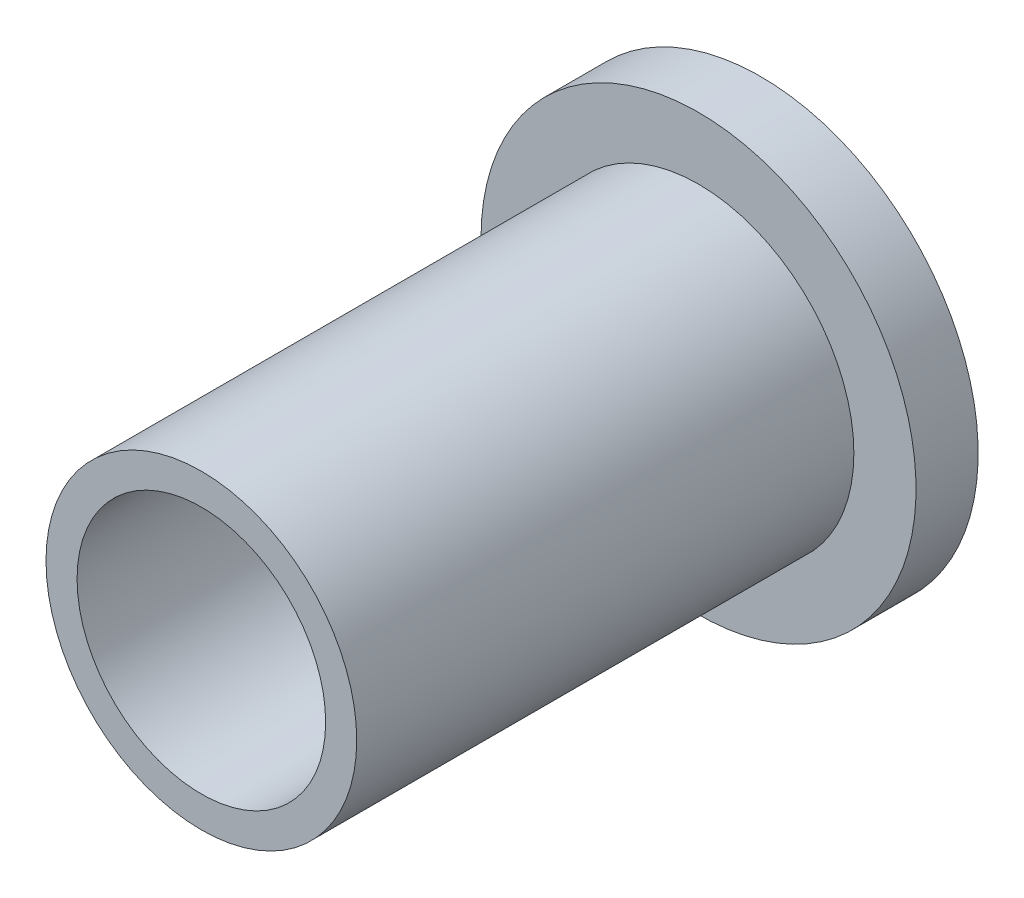
ISO-10303-21;
HEADER;
FILE_DESCRIPTION(('STEP AP214'),'2;1');
FILE_NAME('part.step','',(''),(''),'','','');
FILE_SCHEMA(('AUTOMOTIVE_DESIGN { 1 0 10303 214 1 1 1 1 }'));
ENDSEC;
DATA;
#1=APPLICATION_CONTEXT('core data for automotive mechanical design processes');
#2=APPLICATION_PROTOCOL_DEFINITION('international standard','automotive_design',2000,#1);
#3=PRODUCT_CONTEXT('',#1,'mechanical');
#4=PRODUCT('Part','Part','',(#3));
#5=PRODUCT_RELATED_PRODUCT_CATEGORY('part','',(#4));
#6=PRODUCT_DEFINITION_FORMATION('','',#4);
#7=PRODUCT_DEFINITION_CONTEXT('part definition',#1,'design');
#8=PRODUCT_DEFINITION('design','',#6,#7);
#9=PRODUCT_DEFINITION_SHAPE('','',#8);
#10=(LENGTH_UNIT() NAMED_UNIT(*) SI_UNIT(.MILLI.,.METRE.));
#11=(NAMED_UNIT(*) PLANE_ANGLE_UNIT() SI_UNIT($,.RADIAN.));
#12=(NAMED_UNIT(*) SI_UNIT($,.STERADIAN.) SOLID_ANGLE_UNIT());
#13=UNCERTAINTY_MEASURE_WITH_UNIT(LENGTH_MEASURE(1.E-05),#10,'distance_accuracy_value','');
#14=(GEOMETRIC_REPRESENTATION_CONTEXT(3) GLOBAL_UNCERTAINTY_ASSIGNED_CONTEXT((#13)) GLOBAL_UNIT_ASSIGNED_CONTEXT((#10,
#11,#12)) REPRESENTATION_CONTEXT('',''));
#15=CARTESIAN_POINT('',(0.,0.,0.));
#16=DIRECTION('',(0.,0.,1.));
#17=DIRECTION('',(1.,0.,0.));
#18=AXIS2_PLACEMENT_3D('',#15,#16,#17);
#19=CARTESIAN_POINT('',(0.,0.,25.4));
#20=DIRECTION('',(0.,0.,1.));
#21=DIRECTION('',(1.,0.,0.));
#22=AXIS2_PLACEMENT_3D('',#19,#20,#21);
#23=PLANE('',#22);
#24=CARTESIAN_POINT('',(0.,0.,25.4));
#25=DIRECTION('',(0.,0.,1.));
#26=DIRECTION('',(1.,0.,0.));
#27=AXIS2_PLACEMENT_3D('',#24,#25,#26);
#28=CIRCLE('',#27,7.9375);
#29=CARTESIAN_POINT('',(7.9375,0.,25.4));
#30=VERTEX_POINT('',#29);
#31=EDGE_CURVE('E10',#30,#30,#28,.T.);
#32=ORIENTED_EDGE('',*,*,#31,.T.);
#33=EDGE_LOOP('',(#32));
#34=FACE_BOUND('',#33,.T.);
#35=CARTESIAN_POINT('',(0.,0.,25.4));
#36=DIRECTION('',(0.,0.,1.));
#37=DIRECTION('',(1.,0.,0.));
#38=AXIS2_PLACEMENT_3D('',#35,#36,#37);
#39=CIRCLE('',#38,6.35);
#40=CARTESIAN_POINT('',(6.35,0.,25.4));
#41=VERTEX_POINT('',#40);
#42=EDGE_CURVE('E38',#41,#41,#39,.T.);
#43=ORIENTED_EDGE('',*,*,#42,.F.);
#44=EDGE_LOOP('',(#43));
#45=FACE_BOUND('',#44,.T.);
#46=ADVANCED_FACE('F31',(#34,#45),#23,.T.);
#47=CARTESIAN_POINT('',(0.,0.,25.4));
#48=DIRECTION('',(0.,0.,-1.));
#49=DIRECTION('',(-1.,0.,0.));
#50=AXIS2_PLACEMENT_3D('',#47,#48,#49);
#51=CYLINDRICAL_SURFACE('',#50,7.9375);
#52=ORIENTED_EDGE('',*,*,#31,.F.);
#53=EDGE_LOOP('',(#52));
#54=FACE_BOUND('',#53,.T.);
#55=CARTESIAN_POINT('',(0.,0.,0.));
#56=DIRECTION('',(0.,0.,-1.));
#57=DIRECTION('',(-1.,0.,0.));
#58=AXIS2_PLACEMENT_3D('',#55,#56,#57);
#59=CIRCLE('',#58,7.9375);
#60=CARTESIAN_POINT('',(-7.9375,0.,0.));
#61=VERTEX_POINT('',#60);
#62=EDGE_CURVE('E42',#61,#61,#59,.T.);
#63=ORIENTED_EDGE('',*,*,#62,.F.);
#64=EDGE_LOOP('',(#63));
#65=FACE_BOUND('',#64,.T.);
#66=ADVANCED_FACE('F33',(#54,#65),#51,.T.);
#67=CARTESIAN_POINT('',(0.,0.,25.4));
#68=DIRECTION('',(0.,0.,-1.));
#69=DIRECTION('',(-1.,0.,0.));
#70=AXIS2_PLACEMENT_3D('',#67,#68,#69);
#71=CYLINDRICAL_SURFACE('',#70,6.35);
#72=ORIENTED_EDGE('',*,*,#42,.T.);
#73=EDGE_LOOP('',(#72));
#74=FACE_BOUND('',#73,.T.);
#75=CARTESIAN_POINT('',(0.,0.,-3.175));
#76=DIRECTION('',(0.,0.,-1.));
#77=DIRECTION('',(-1.,0.,0.));
#78=AXIS2_PLACEMENT_3D('',#75,#76,#77);
#79=CIRCLE('',#78,6.35);
#80=CARTESIAN_POINT('',(-6.35,0.,-3.175));
#81=VERTEX_POINT('',#80);
#82=EDGE_CURVE('E52',#81,#81,#79,.T.);
#83=ORIENTED_EDGE('',*,*,#82,.T.);
#84=EDGE_LOOP('',(#83));
#85=FACE_BOUND('',#84,.T.);
#86=ADVANCED_FACE('F58',(#74,#85),#71,.F.);
#87=CARTESIAN_POINT('',(0.,0.,0.));
#88=DIRECTION('',(0.,0.,-1.));
#89=DIRECTION('',(-1.,0.,0.));
#90=AXIS2_PLACEMENT_3D('',#87,#88,#89);
#91=PLANE('',#90);
#92=CARTESIAN_POINT('',(0.,0.,0.));
#93=DIRECTION('',(0.,0.,-1.));
#94=DIRECTION('',(-1.,0.,0.));
#95=AXIS2_PLACEMENT_3D('',#92,#93,#94);
#96=CIRCLE('',#95,11.1125);
#97=CARTESIAN_POINT('',(-11.1125,0.,0.));
#98=VERTEX_POINT('',#97);
#99=EDGE_CURVE('E49',#98,#98,#96,.T.);
#100=ORIENTED_EDGE('',*,*,#99,.F.);
#101=EDGE_LOOP('',(#100));
#102=FACE_BOUND('',#101,.T.);
#103=ORIENTED_EDGE('',*,*,#62,.T.);
#104=EDGE_LOOP('',(#103));
#105=FACE_BOUND('',#104,.T.);
#106=ADVANCED_FACE('F63',(#102,#105),#91,.F.);
#107=CARTESIAN_POINT('',(0.,0.,-3.175));
#108=DIRECTION('',(0.,0.,-1.));
#109=DIRECTION('',(-1.,0.,0.));
#110=AXIS2_PLACEMENT_3D('',#107,#108,#109);
#111=PLANE('',#110);
#112=CARTESIAN_POINT('',(0.,0.,-3.175));
#113=DIRECTION('',(0.,0.,-1.));
#114=DIRECTION('',(-1.,0.,0.));
#115=AXIS2_PLACEMENT_3D('',#112,#113,#114);
#116=CIRCLE('',#115,11.1125);
#117=CARTESIAN_POINT('',(-11.1125,0.,-3.175));
#118=VERTEX_POINT('',#117);
#119=EDGE_CURVE('E46',#118,#118,#116,.T.);
#120=ORIENTED_EDGE('',*,*,#119,.T.);
#121=EDGE_LOOP('',(#120));
#122=FACE_BOUND('',#121,.T.);
#123=ORIENTED_EDGE('',*,*,#82,.F.);
#124=EDGE_LOOP('',(#123));
#125=FACE_BOUND('',#124,.T.);
#126=ADVANCED_FACE('F60',(#122,#125),#111,.T.);
#127=CARTESIAN_POINT('',(0.,0.,-3.175));
#128=DIRECTION('',(0.,0.,1.));
#129=DIRECTION('',(1.,0.,0.));
#130=AXIS2_PLACEMENT_3D('',#127,#128,#129);
#131=CYLINDRICAL_SURFACE('',#130,11.1125);
#132=ORIENTED_EDGE('',*,*,#119,.F.);
#133=EDGE_LOOP('',(#132));
#134=FACE_BOUND('',#133,.T.);
#135=ORIENTED_EDGE('',*,*,#99,.T.);
#136=EDGE_LOOP('',(#135));
#137=FACE_BOUND('',#136,.T.);
#138=ADVANCED_FACE('F62',(#134,#137),#131,.T.);
#139=CLOSED_SHELL('',(#46,#66,#86,#106,#126,#138));
#140=MANIFOLD_SOLID_BREP('B2',#139);
#141=ADVANCED_BREP_SHAPE_REPRESENTATION('',(#18,#140),#14);
#142=SHAPE_DEFINITION_REPRESENTATION(#9,#141);
ENDSEC;
END-ISO-10303-21;
